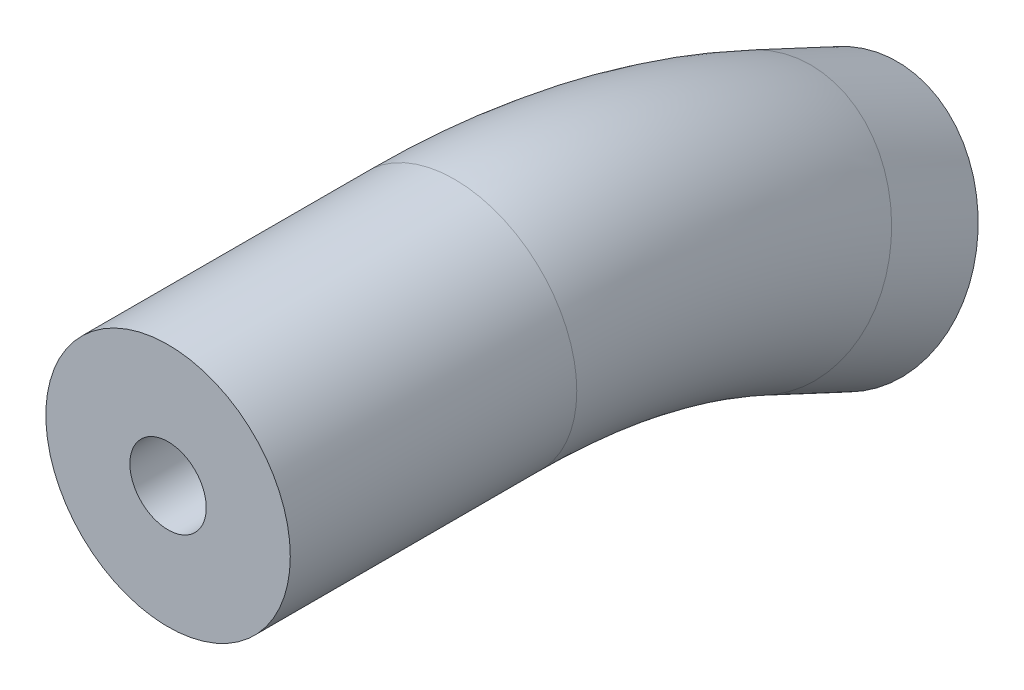
ISO-10303-21;
HEADER;
FILE_DESCRIPTION(('STEP AP214'),'2;1');
FILE_NAME('part.step','',(''),(''),'','','');
FILE_SCHEMA(('AUTOMOTIVE_DESIGN { 1 0 10303 214 1 1 1 1 }'));
ENDSEC;
DATA;
#1=APPLICATION_CONTEXT('core data for automotive mechanical design processes');
#2=APPLICATION_PROTOCOL_DEFINITION('international standard','automotive_design',2000,#1);
#3=PRODUCT_CONTEXT('',#1,'mechanical');
#4=PRODUCT('Part','Part','',(#3));
#5=PRODUCT_RELATED_PRODUCT_CATEGORY('part','',(#4));
#6=PRODUCT_DEFINITION_FORMATION('','',#4);
#7=PRODUCT_DEFINITION_CONTEXT('part definition',#1,'design');
#8=PRODUCT_DEFINITION('design','',#6,#7);
#9=PRODUCT_DEFINITION_SHAPE('','',#8);
#10=(LENGTH_UNIT() NAMED_UNIT(*) SI_UNIT(.MILLI.,.METRE.));
#11=(NAMED_UNIT(*) PLANE_ANGLE_UNIT() SI_UNIT($,.RADIAN.));
#12=(NAMED_UNIT(*) SI_UNIT($,.STERADIAN.) SOLID_ANGLE_UNIT());
#13=UNCERTAINTY_MEASURE_WITH_UNIT(LENGTH_MEASURE(1.E-05),#10,'distance_accuracy_value','');
#14=(GEOMETRIC_REPRESENTATION_CONTEXT(3) GLOBAL_UNCERTAINTY_ASSIGNED_CONTEXT((#13)) GLOBAL_UNIT_ASSIGNED_CONTEXT((#10,
#11,#12)) REPRESENTATION_CONTEXT('',''));
#15=CARTESIAN_POINT('',(0.,0.,0.));
#16=DIRECTION('',(0.,0.,1.));
#17=DIRECTION('',(1.,0.,0.));
#18=AXIS2_PLACEMENT_3D('',#15,#16,#17);
#19=CARTESIAN_POINT('',(6.125,-4.2,-8.02));
#20=DIRECTION('',(0.,0.,-1.));
#21=DIRECTION('',(-1.,0.,0.));
#22=AXIS2_PLACEMENT_3D('',#19,#20,#21);
#23=CYLINDRICAL_SURFACE('',#22,0.2);
#24=CARTESIAN_POINT('',(6.125,-4.2,-9.52));
#25=DIRECTION('',(0.,0.,1.));
#26=DIRECTION('',(1.,0.,0.));
#27=AXIS2_PLACEMENT_3D('',#24,#25,#26);
#28=CIRCLE('',#27,0.2);
#29=CARTESIAN_POINT('',(6.325,-4.2,-9.52));
#30=VERTEX_POINT('',#29);
#31=EDGE_CURVE('E62',#30,#30,#28,.T.);
#32=ORIENTED_EDGE('',*,*,#31,.F.);
#33=EDGE_LOOP('',(#32));
#34=FACE_BOUND('',#33,.T.);
#35=CARTESIAN_POINT('',(6.125,-4.2,-8.02));
#36=DIRECTION('',(0.,0.,-1.));
#37=DIRECTION('',(-1.,0.,0.));
#38=AXIS2_PLACEMENT_3D('',#35,#36,#37);
#39=CIRCLE('',#38,0.2);
#40=CARTESIAN_POINT('',(5.925,-4.2,-8.02));
#41=VERTEX_POINT('',#40);
#42=EDGE_CURVE('E56',#41,#41,#39,.T.);
#43=ORIENTED_EDGE('',*,*,#42,.F.);
#44=EDGE_LOOP('',(#43));
#45=FACE_BOUND('',#44,.T.);
#46=ADVANCED_FACE('F17',(#34,#45),#23,.F.);
#47=CARTESIAN_POINT('',(6.125,-7.97099703639013,-9.52));
#48=DIRECTION('',(1.,0.,0.));
#49=DIRECTION('',(0.,0.,-1.));
#50=AXIS2_PLACEMENT_3D('',#47,#48,#49);
#51=TOROIDAL_SURFACE('',#50,3.77099703639014,0.200000000000003);
#52=ORIENTED_EDGE('',*,*,#31,.T.);
#53=EDGE_LOOP('',(#52));
#54=FACE_BOUND('',#53,.T.);
#55=CARTESIAN_POINT('',(6.125,-4.5533130573974,-11.1136922125105));
#56=DIRECTION('',(0.,0.422618261740958,0.906307787036529));
#57=DIRECTION('',(0.,-0.906307787036529,0.422618261740959));
#58=AXIS2_PLACEMENT_3D('',#55,#56,#57);
#59=CIRCLE('',#58,0.200000000000007);
#60=CARTESIAN_POINT('',(6.125,-4.73457461480471,-11.0291685601623));
#61=VERTEX_POINT('',#60);
#62=EDGE_CURVE('E53',#61,#61,#59,.T.);
#63=ORIENTED_EDGE('',*,*,#62,.F.);
#64=EDGE_LOOP('',(#63));
#65=FACE_BOUND('',#64,.T.);
#66=ADVANCED_FACE('F66',(#54,#65),#51,.F.);
#67=CARTESIAN_POINT('',(6.766,-3.559,-8.02));
#68=DIRECTION('',(0.,0.,1.));
#69=DIRECTION('',(-1.,0.,0.));
#70=AXIS2_PLACEMENT_3D('',#67,#68,#69);
#71=PLANE('',#70);
#72=ORIENTED_EDGE('',*,*,#42,.T.);
#73=EDGE_LOOP('',(#72));
#74=FACE_BOUND('',#73,.T.);
#75=CARTESIAN_POINT('',(6.125,-4.2,-8.02));
#76=DIRECTION('',(0.,0.,1.));
#77=DIRECTION('',(1.,0.,0.));
#78=AXIS2_PLACEMENT_3D('',#75,#76,#77);
#79=CIRCLE('',#78,0.64);
#80=CARTESIAN_POINT('',(6.765,-4.2,-8.02));
#81=VERTEX_POINT('',#80);
#82=EDGE_CURVE('E48',#81,#81,#79,.F.);
#83=ORIENTED_EDGE('',*,*,#82,.F.);
#84=EDGE_LOOP('',(#83));
#85=FACE_BOUND('',#84,.T.);
#86=ADVANCED_FACE('F74',(#74,#85),#71,.T.);
#87=CARTESIAN_POINT('',(6.125,-4.5533130573974,-11.1136922125105));
#88=DIRECTION('',(0.,-0.422618261740959,-0.906307787036529));
#89=DIRECTION('',(0.,0.906307787036529,-0.422618261740959));
#90=AXIS2_PLACEMENT_3D('',#87,#88,#89);
#91=CYLINDRICAL_SURFACE('',#90,0.200000000000007);
#92=CARTESIAN_POINT('',(6.125,-4.7646221884788,-11.5668461064811));
#93=DIRECTION('',(0.,-0.422618261740959,-0.906307787036529));
#94=DIRECTION('',(0.,0.906307787036529,-0.422618261740959));
#95=AXIS2_PLACEMENT_3D('',#92,#93,#94);
#96=CIRCLE('',#95,0.200000000000007);
#97=CARTESIAN_POINT('',(6.125,-4.58336063107149,-11.6513697588293));
#98=VERTEX_POINT('',#97);
#99=EDGE_CURVE('E45',#98,#98,#96,.F.);
#100=ORIENTED_EDGE('',*,*,#99,.F.);
#101=EDGE_LOOP('',(#100));
#102=FACE_BOUND('',#101,.T.);
#103=ORIENTED_EDGE('',*,*,#62,.T.);
#104=EDGE_LOOP('',(#103));
#105=FACE_BOUND('',#104,.T.);
#106=ADVANCED_FACE('F77',(#102,#105),#91,.F.);
#107=CARTESIAN_POINT('',(6.125,-4.2,-9.52));
#108=DIRECTION('',(0.,0.,1.));
#109=DIRECTION('',(1.,0.,0.));
#110=AXIS2_PLACEMENT_3D('',#107,#108,#109);
#111=CYLINDRICAL_SURFACE('',#110,0.64);
#112=ORIENTED_EDGE('',*,*,#82,.T.);
#113=EDGE_LOOP('',(#112));
#114=FACE_BOUND('',#113,.T.);
#115=CARTESIAN_POINT('',(6.125,-4.2,-9.52));
#116=DIRECTION('',(0.,0.,-1.));
#117=DIRECTION('',(-1.,0.,0.));
#118=AXIS2_PLACEMENT_3D('',#115,#116,#117);
#119=CIRCLE('',#118,0.64);
#120=CARTESIAN_POINT('',(5.485,-4.2,-9.52));
#121=VERTEX_POINT('',#120);
#122=EDGE_CURVE('E36',#121,#121,#119,.T.);
#123=ORIENTED_EDGE('',*,*,#122,.F.);
#124=EDGE_LOOP('',(#123));
#125=FACE_BOUND('',#124,.T.);
#126=ADVANCED_FACE('F81',(#114,#125),#111,.T.);
#127=CARTESIAN_POINT('',(5.484,-4.18367889700396,-11.8377444122497));
#128=DIRECTION('',(0.,-0.422618261740863,-0.906307787036574));
#129=DIRECTION('',(1.,0.,0.));
#130=AXIS2_PLACEMENT_3D('',#127,#128,#129);
#131=PLANE('',#130);
#132=ORIENTED_EDGE('',*,*,#99,.T.);
#133=EDGE_LOOP('',(#132));
#134=FACE_BOUND('',#133,.T.);
#135=CARTESIAN_POINT('',(6.12500000000001,-4.76462218847872,-11.5668461064811));
#136=DIRECTION('',(0.,0.422618261740778,0.906307787036613));
#137=DIRECTION('',(0.,-0.906307787036613,0.422618261740778));
#138=AXIS2_PLACEMENT_3D('',#135,#136,#137);
#139=CIRCLE('',#138,0.640000000000002);
#140=CARTESIAN_POINT('',(6.12500000000001,-5.34465917218216,-11.296370418967));
#141=VERTEX_POINT('',#140);
#142=EDGE_CURVE('E26',#141,#141,#139,.T.);
#143=ORIENTED_EDGE('',*,*,#142,.F.);
#144=EDGE_LOOP('',(#143));
#145=FACE_BOUND('',#144,.T.);
#146=ADVANCED_FACE('F41',(#134,#145),#131,.T.);
#147=CARTESIAN_POINT('',(6.12500000000002,-7.97099703645936,-9.51999999998462));
#148=DIRECTION('',(1.,0.,0.));
#149=DIRECTION('',(0.,1.,0.));
#150=AXIS2_PLACEMENT_3D('',#147,#148,#149);
#151=TOROIDAL_SURFACE('',#150,3.77099703645937,0.640000000000001);
#152=CARTESIAN_POINT('',(6.125,-4.55331305739947,-11.1136922125096));
#153=DIRECTION('',(0.,0.422618261730355,0.906307787041474));
#154=DIRECTION('',(0.,-0.906307787041474,0.422618261730355));
#155=AXIS2_PLACEMENT_3D('',#152,#153,#154);
#156=CIRCLE('',#155,0.640000000000001);
#157=CARTESIAN_POINT('',(5.485,-4.55331305740871,-11.1136922125052));
#158=VERTEX_POINT('',#157);
#159=CARTESIAN_POINT('',(6.125,-5.13335004111153,-10.8432165250153));
#160=VERTEX_POINT('',#159);
#161=EDGE_CURVE('E33',#158,#160,#156,.T.);
#162=ORIENTED_EDGE('',*,*,#161,.T.);
#163=CARTESIAN_POINT('',(6.125,-4.5533130573974,-11.1136922125105));
#164=DIRECTION('',(0.,-0.422618261740916,-0.906307787036549));
#165=DIRECTION('',(0.,0.906307787036549,-0.422618261740916));
#166=AXIS2_PLACEMENT_3D('',#163,#164,#165);
#167=CIRCLE('',#166,0.640000000000015);
#168=EDGE_CURVE('E11',#158,#160,#167,.T.);
#169=ORIENTED_EDGE('',*,*,#168,.F.);
#170=EDGE_LOOP('',(#162,#169));
#171=FACE_BOUND('',#170,.T.);
#172=ORIENTED_EDGE('',*,*,#122,.T.);
#173=EDGE_LOOP('',(#172));
#174=FACE_BOUND('',#173,.T.);
#175=ADVANCED_FACE('F38',(#171,#174),#151,.T.);
#176=CARTESIAN_POINT('',(6.12500000000001,-4.7646221884443,-11.5668461064073));
#177=DIRECTION('',(0.,0.422618261740778,0.906307787036613));
#178=DIRECTION('',(0.,-0.906307787036613,0.422618261740778));
#179=AXIS2_PLACEMENT_3D('',#176,#177,#178);
#180=CYLINDRICAL_SURFACE('',#179,0.640000000000002);
#181=ORIENTED_EDGE('',*,*,#161,.F.);
#182=ORIENTED_EDGE('',*,*,#168,.T.);
#183=EDGE_LOOP('',(#181,#182));
#184=FACE_BOUND('',#183,.T.);
#185=ORIENTED_EDGE('',*,*,#142,.T.);
#186=EDGE_LOOP('',(#185));
#187=FACE_BOUND('',#186,.T.);
#188=ADVANCED_FACE('F19',(#184,#187),#180,.T.);
#189=CLOSED_SHELL('',(#46,#66,#86,#106,#126,#146,#175,#188));
#190=MANIFOLD_SOLID_BREP('B1',#189);
#191=ADVANCED_BREP_SHAPE_REPRESENTATION('',(#18,#190),#14);
#192=SHAPE_DEFINITION_REPRESENTATION(#9,#191);
ENDSEC;
END-ISO-10303-21;
